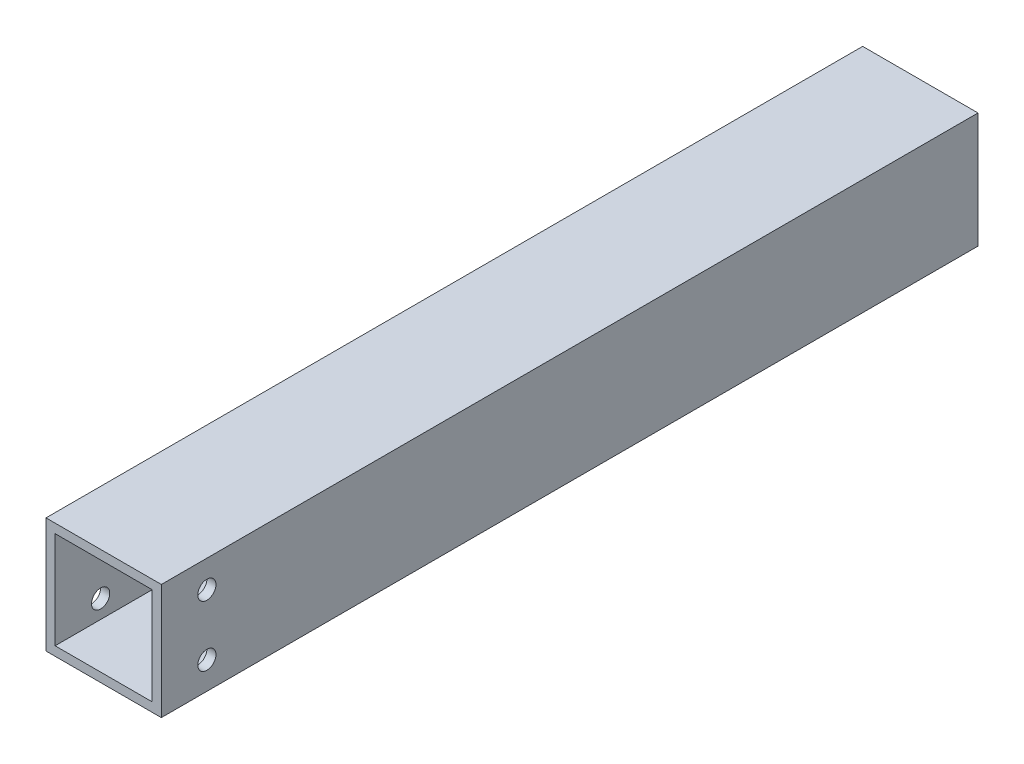
ISO-10303-21;
HEADER;
FILE_DESCRIPTION(('STEP AP214'),'2;1');
FILE_NAME('part.step','',(''),(''),'','','');
FILE_SCHEMA(('AUTOMOTIVE_DESIGN { 1 0 10303 214 1 1 1 1 }'));
ENDSEC;
DATA;
#1=APPLICATION_CONTEXT('core data for automotive mechanical design processes');
#2=APPLICATION_PROTOCOL_DEFINITION('international standard','automotive_design',2000,#1);
#3=PRODUCT_CONTEXT('',#1,'mechanical');
#4=PRODUCT('Part','Part','',(#3));
#5=PRODUCT_RELATED_PRODUCT_CATEGORY('part','',(#4));
#6=PRODUCT_DEFINITION_FORMATION('','',#4);
#7=PRODUCT_DEFINITION_CONTEXT('part definition',#1,'design');
#8=PRODUCT_DEFINITION('design','',#6,#7);
#9=PRODUCT_DEFINITION_SHAPE('','',#8);
#10=(LENGTH_UNIT() NAMED_UNIT(*) SI_UNIT(.MILLI.,.METRE.));
#11=(NAMED_UNIT(*) PLANE_ANGLE_UNIT() SI_UNIT($,.RADIAN.));
#12=(NAMED_UNIT(*) SI_UNIT($,.STERADIAN.) SOLID_ANGLE_UNIT());
#13=UNCERTAINTY_MEASURE_WITH_UNIT(LENGTH_MEASURE(1.E-05),#10,'distance_accuracy_value','');
#14=(GEOMETRIC_REPRESENTATION_CONTEXT(3) GLOBAL_UNCERTAINTY_ASSIGNED_CONTEXT((#13)) GLOBAL_UNIT_ASSIGNED_CONTEXT((#10,
#11,#12)) REPRESENTATION_CONTEXT('',''));
#15=CARTESIAN_POINT('',(0.,0.,0.));
#16=DIRECTION('',(0.,0.,1.));
#17=DIRECTION('',(1.,0.,0.));
#18=AXIS2_PLACEMENT_3D('',#15,#16,#17);
#19=CARTESIAN_POINT('',(0.,0.,269.06));
#20=DIRECTION('',(0.,0.,-1.));
#21=DIRECTION('',(-1.,0.,0.));
#22=AXIS2_PLACEMENT_3D('',#19,#20,#21);
#23=PLANE('',#22);
#24=DIRECTION('',(0.,1.,0.));
#25=VECTOR('',#24,1.);
#26=CARTESIAN_POINT('',(19.,-19.,269.06));
#27=LINE('',#26,#25);
#28=CARTESIAN_POINT('',(19.,-19.,269.06));
#29=VERTEX_POINT('',#28);
#30=CARTESIAN_POINT('',(19.,19.,269.06));
#31=VERTEX_POINT('',#30);
#32=EDGE_CURVE('E146',#29,#31,#27,.T.);
#33=ORIENTED_EDGE('',*,*,#32,.T.);
#34=DIRECTION('',(-1.,0.,0.));
#35=VECTOR('',#34,1.);
#36=CARTESIAN_POINT('',(-19.,19.,269.06));
#37=LINE('',#36,#35);
#38=CARTESIAN_POINT('',(-19.,19.,269.06));
#39=VERTEX_POINT('',#38);
#40=EDGE_CURVE('E149',#31,#39,#37,.T.);
#41=ORIENTED_EDGE('',*,*,#40,.T.);
#42=DIRECTION('',(0.,-1.,0.));
#43=VECTOR('',#42,1.);
#44=CARTESIAN_POINT('',(-19.,-19.,269.06));
#45=LINE('',#44,#43);
#46=CARTESIAN_POINT('',(-19.,-19.,269.06));
#47=VERTEX_POINT('',#46);
#48=EDGE_CURVE('E152',#39,#47,#45,.T.);
#49=ORIENTED_EDGE('',*,*,#48,.T.);
#50=DIRECTION('',(1.,0.,0.));
#51=VECTOR('',#50,1.);
#52=CARTESIAN_POINT('',(-19.,-19.,269.06));
#53=LINE('',#52,#51);
#54=EDGE_CURVE('E154',#47,#29,#53,.T.);
#55=ORIENTED_EDGE('',*,*,#54,.T.);
#56=EDGE_LOOP('',(#33,#41,#49,#55));
#57=FACE_BOUND('',#56,.T.);
#58=DIRECTION('',(0.,-1.,0.));
#59=VECTOR('',#58,1.);
#60=CARTESIAN_POINT('',(-16.,-16.,269.06));
#61=LINE('',#60,#59);
#62=CARTESIAN_POINT('',(-16.,16.,269.06));
#63=VERTEX_POINT('',#62);
#64=CARTESIAN_POINT('',(-16.,-16.,269.06));
#65=VERTEX_POINT('',#64);
#66=EDGE_CURVE('E108',#63,#65,#61,.T.);
#67=ORIENTED_EDGE('',*,*,#66,.F.);
#68=DIRECTION('',(-1.,0.,0.));
#69=VECTOR('',#68,1.);
#70=CARTESIAN_POINT('',(-16.,16.,269.06));
#71=LINE('',#70,#69);
#72=CARTESIAN_POINT('',(16.,16.,269.06));
#73=VERTEX_POINT('',#72);
#74=EDGE_CURVE('E130',#73,#63,#71,.T.);
#75=ORIENTED_EDGE('',*,*,#74,.F.);
#76=DIRECTION('',(0.,1.,0.));
#77=VECTOR('',#76,1.);
#78=CARTESIAN_POINT('',(16.,-16.,269.06));
#79=LINE('',#78,#77);
#80=CARTESIAN_POINT('',(16.,-16.,269.06));
#81=VERTEX_POINT('',#80);
#82=EDGE_CURVE('E128',#81,#73,#79,.T.);
#83=ORIENTED_EDGE('',*,*,#82,.F.);
#84=DIRECTION('',(1.,0.,0.));
#85=VECTOR('',#84,1.);
#86=CARTESIAN_POINT('',(-16.,-16.,269.06));
#87=LINE('',#86,#85);
#88=EDGE_CURVE('E116',#65,#81,#87,.T.);
#89=ORIENTED_EDGE('',*,*,#88,.F.);
#90=EDGE_LOOP('',(#67,#75,#83,#89));
#91=FACE_BOUND('',#90,.T.);
#92=ADVANCED_FACE('F41',(#57,#91),#23,.F.);
#93=CARTESIAN_POINT('',(0.,0.,0.));
#94=DIRECTION('',(0.,0.,-1.));
#95=DIRECTION('',(-1.,0.,0.));
#96=AXIS2_PLACEMENT_3D('',#93,#94,#95);
#97=PLANE('',#96);
#98=DIRECTION('',(0.,1.,0.));
#99=VECTOR('',#98,1.);
#100=CARTESIAN_POINT('',(19.,-19.,0.));
#101=LINE('',#100,#99);
#102=CARTESIAN_POINT('',(19.,-19.,0.));
#103=VERTEX_POINT('',#102);
#104=CARTESIAN_POINT('',(19.,19.,0.));
#105=VERTEX_POINT('',#104);
#106=EDGE_CURVE('E124',#103,#105,#101,.T.);
#107=ORIENTED_EDGE('',*,*,#106,.F.);
#108=DIRECTION('',(1.,0.,0.));
#109=VECTOR('',#108,1.);
#110=CARTESIAN_POINT('',(-19.,-19.,0.));
#111=LINE('',#110,#109);
#112=CARTESIAN_POINT('',(-19.,-19.,0.));
#113=VERTEX_POINT('',#112);
#114=EDGE_CURVE('E150',#113,#103,#111,.T.);
#115=ORIENTED_EDGE('',*,*,#114,.F.);
#116=DIRECTION('',(0.,-1.,0.));
#117=VECTOR('',#116,1.);
#118=CARTESIAN_POINT('',(-19.,-19.,0.));
#119=LINE('',#118,#117);
#120=CARTESIAN_POINT('',(-19.,19.,0.));
#121=VERTEX_POINT('',#120);
#122=EDGE_CURVE('E161',#121,#113,#119,.T.);
#123=ORIENTED_EDGE('',*,*,#122,.F.);
#124=DIRECTION('',(-1.,0.,0.));
#125=VECTOR('',#124,1.);
#126=CARTESIAN_POINT('',(-19.,19.,0.));
#127=LINE('',#126,#125);
#128=EDGE_CURVE('E159',#105,#121,#127,.T.);
#129=ORIENTED_EDGE('',*,*,#128,.F.);
#130=EDGE_LOOP('',(#107,#115,#123,#129));
#131=FACE_BOUND('',#130,.T.);
#132=DIRECTION('',(-1.,0.,0.));
#133=VECTOR('',#132,1.);
#134=CARTESIAN_POINT('',(-16.,16.,0.));
#135=LINE('',#134,#133);
#136=CARTESIAN_POINT('',(16.,16.,0.));
#137=VERTEX_POINT('',#136);
#138=CARTESIAN_POINT('',(-16.,16.,0.));
#139=VERTEX_POINT('',#138);
#140=EDGE_CURVE('E117',#137,#139,#135,.T.);
#141=ORIENTED_EDGE('',*,*,#140,.T.);
#142=DIRECTION('',(0.,-1.,0.));
#143=VECTOR('',#142,1.);
#144=CARTESIAN_POINT('',(-16.,-16.,0.));
#145=LINE('',#144,#143);
#146=CARTESIAN_POINT('',(-16.,-16.,0.));
#147=VERTEX_POINT('',#146);
#148=EDGE_CURVE('E66',#139,#147,#145,.T.);
#149=ORIENTED_EDGE('',*,*,#148,.T.);
#150=DIRECTION('',(1.,0.,0.));
#151=VECTOR('',#150,1.);
#152=CARTESIAN_POINT('',(-16.,-16.,0.));
#153=LINE('',#152,#151);
#154=CARTESIAN_POINT('',(16.,-16.,0.));
#155=VERTEX_POINT('',#154);
#156=EDGE_CURVE('E123',#147,#155,#153,.T.);
#157=ORIENTED_EDGE('',*,*,#156,.T.);
#158=DIRECTION('',(0.,1.,0.));
#159=VECTOR('',#158,1.);
#160=CARTESIAN_POINT('',(16.,-16.,0.));
#161=LINE('',#160,#159);
#162=EDGE_CURVE('E138',#155,#137,#161,.T.);
#163=ORIENTED_EDGE('',*,*,#162,.T.);
#164=EDGE_LOOP('',(#141,#149,#157,#163));
#165=FACE_BOUND('',#164,.T.);
#166=ADVANCED_FACE('F208',(#131,#165),#97,.T.);
#167=CARTESIAN_POINT('',(19.,-19.,269.06));
#168=DIRECTION('',(-1.,0.,0.));
#169=DIRECTION('',(0.,0.,1.));
#170=AXIS2_PLACEMENT_3D('',#167,#168,#169);
#171=PLANE('',#170);
#172=CARTESIAN_POINT('',(19.,-10.,254.06));
#173=DIRECTION('',(-1.,0.,0.));
#174=DIRECTION('',(0.,0.,1.));
#175=AXIS2_PLACEMENT_3D('',#172,#173,#174);
#176=CIRCLE('',#175,2.99999999999999);
#177=CARTESIAN_POINT('',(19.,-10.,257.06));
#178=VERTEX_POINT('',#177);
#179=EDGE_CURVE('E179',#178,#178,#176,.T.);
#180=ORIENTED_EDGE('',*,*,#179,.T.);
#181=EDGE_LOOP('',(#180));
#182=FACE_BOUND('',#181,.T.);
#183=CARTESIAN_POINT('',(19.,10.,254.06));
#184=DIRECTION('',(-1.,0.,0.));
#185=DIRECTION('',(0.,0.,1.));
#186=AXIS2_PLACEMENT_3D('',#183,#184,#185);
#187=CIRCLE('',#186,2.99999999999999);
#188=CARTESIAN_POINT('',(19.,10.,257.06));
#189=VERTEX_POINT('',#188);
#190=EDGE_CURVE('E136',#189,#189,#187,.T.);
#191=ORIENTED_EDGE('',*,*,#190,.T.);
#192=EDGE_LOOP('',(#191));
#193=FACE_BOUND('',#192,.T.);
#194=ORIENTED_EDGE('',*,*,#106,.T.);
#195=DIRECTION('',(0.,0.,-1.));
#196=VECTOR('',#195,1.);
#197=CARTESIAN_POINT('',(19.,19.,269.06));
#198=LINE('',#197,#196);
#199=EDGE_CURVE('E11',#31,#105,#198,.T.);
#200=ORIENTED_EDGE('',*,*,#199,.F.);
#201=ORIENTED_EDGE('',*,*,#32,.F.);
#202=DIRECTION('',(0.,0.,-1.));
#203=VECTOR('',#202,1.);
#204=CARTESIAN_POINT('',(19.,-19.,269.06));
#205=LINE('',#204,#203);
#206=EDGE_CURVE('E156',#29,#103,#205,.T.);
#207=ORIENTED_EDGE('',*,*,#206,.T.);
#208=EDGE_LOOP('',(#194,#200,#201,#207));
#209=FACE_BOUND('',#208,.T.);
#210=ADVANCED_FACE('F43',(#182,#193,#209),#171,.F.);
#211=CARTESIAN_POINT('',(-19.,19.,269.06));
#212=DIRECTION('',(0.,-1.,0.));
#213=DIRECTION('',(0.,0.,-1.));
#214=AXIS2_PLACEMENT_3D('',#211,#212,#213);
#215=PLANE('',#214);
#216=ORIENTED_EDGE('',*,*,#128,.T.);
#217=DIRECTION('',(0.,0.,-1.));
#218=VECTOR('',#217,1.);
#219=CARTESIAN_POINT('',(-19.,19.,269.06));
#220=LINE('',#219,#218);
#221=EDGE_CURVE('E50',#39,#121,#220,.T.);
#222=ORIENTED_EDGE('',*,*,#221,.F.);
#223=ORIENTED_EDGE('',*,*,#40,.F.);
#224=ORIENTED_EDGE('',*,*,#199,.T.);
#225=EDGE_LOOP('',(#216,#222,#223,#224));
#226=FACE_BOUND('',#225,.T.);
#227=ADVANCED_FACE('F225',(#226),#215,.F.);
#228=CARTESIAN_POINT('',(-19.,-19.,269.06));
#229=DIRECTION('',(1.,0.,0.));
#230=DIRECTION('',(0.,0.,-1.));
#231=AXIS2_PLACEMENT_3D('',#228,#229,#230);
#232=PLANE('',#231);
#233=CARTESIAN_POINT('',(-19.,-10.,254.06));
#234=DIRECTION('',(1.,0.,0.));
#235=DIRECTION('',(0.,0.,-1.));
#236=AXIS2_PLACEMENT_3D('',#233,#234,#235);
#237=CIRCLE('',#236,2.99999999999999);
#238=CARTESIAN_POINT('',(-19.,-10.,251.06));
#239=VERTEX_POINT('',#238);
#240=EDGE_CURVE('E257',#239,#239,#237,.T.);
#241=ORIENTED_EDGE('',*,*,#240,.T.);
#242=EDGE_LOOP('',(#241));
#243=FACE_BOUND('',#242,.T.);
#244=CARTESIAN_POINT('',(-19.,10.,254.06));
#245=DIRECTION('',(1.,0.,0.));
#246=DIRECTION('',(0.,0.,-1.));
#247=AXIS2_PLACEMENT_3D('',#244,#245,#246);
#248=CIRCLE('',#247,2.99999999999999);
#249=CARTESIAN_POINT('',(-19.,10.,251.06));
#250=VERTEX_POINT('',#249);
#251=EDGE_CURVE('E173',#250,#250,#248,.T.);
#252=ORIENTED_EDGE('',*,*,#251,.T.);
#253=EDGE_LOOP('',(#252));
#254=FACE_BOUND('',#253,.T.);
#255=ORIENTED_EDGE('',*,*,#122,.T.);
#256=DIRECTION('',(0.,0.,-1.));
#257=VECTOR('',#256,1.);
#258=CARTESIAN_POINT('',(-19.,-19.,269.06));
#259=LINE('',#258,#257);
#260=EDGE_CURVE('E166',#47,#113,#259,.T.);
#261=ORIENTED_EDGE('',*,*,#260,.F.);
#262=ORIENTED_EDGE('',*,*,#48,.F.);
#263=ORIENTED_EDGE('',*,*,#221,.T.);
#264=EDGE_LOOP('',(#255,#261,#262,#263));
#265=FACE_BOUND('',#264,.T.);
#266=ADVANCED_FACE('F222',(#243,#254,#265),#232,.F.);
#267=CARTESIAN_POINT('',(-19.,-19.,269.06));
#268=DIRECTION('',(0.,1.,0.));
#269=DIRECTION('',(0.,0.,1.));
#270=AXIS2_PLACEMENT_3D('',#267,#268,#269);
#271=PLANE('',#270);
#272=ORIENTED_EDGE('',*,*,#114,.T.);
#273=ORIENTED_EDGE('',*,*,#206,.F.);
#274=ORIENTED_EDGE('',*,*,#54,.F.);
#275=ORIENTED_EDGE('',*,*,#260,.T.);
#276=EDGE_LOOP('',(#272,#273,#274,#275));
#277=FACE_BOUND('',#276,.T.);
#278=ADVANCED_FACE('F219',(#277),#271,.F.);
#279=CARTESIAN_POINT('',(-16.,-16.,269.06));
#280=DIRECTION('',(1.,0.,0.));
#281=DIRECTION('',(0.,0.,-1.));
#282=AXIS2_PLACEMENT_3D('',#279,#280,#281);
#283=PLANE('',#282);
#284=CARTESIAN_POINT('',(-16.,-10.,254.06));
#285=DIRECTION('',(1.,0.,0.));
#286=DIRECTION('',(0.,0.,-1.));
#287=AXIS2_PLACEMENT_3D('',#284,#285,#286);
#288=CIRCLE('',#287,2.99999999999999);
#289=CARTESIAN_POINT('',(-16.,-10.,251.06));
#290=VERTEX_POINT('',#289);
#291=EDGE_CURVE('E184',#290,#290,#288,.T.);
#292=ORIENTED_EDGE('',*,*,#291,.F.);
#293=EDGE_LOOP('',(#292));
#294=FACE_BOUND('',#293,.T.);
#295=CARTESIAN_POINT('',(-16.,10.,254.06));
#296=DIRECTION('',(1.,0.,0.));
#297=DIRECTION('',(0.,0.,-1.));
#298=AXIS2_PLACEMENT_3D('',#295,#296,#297);
#299=CIRCLE('',#298,2.99999999999999);
#300=CARTESIAN_POINT('',(-16.,10.,251.06));
#301=VERTEX_POINT('',#300);
#302=EDGE_CURVE('E172',#301,#301,#299,.T.);
#303=ORIENTED_EDGE('',*,*,#302,.F.);
#304=EDGE_LOOP('',(#303));
#305=FACE_BOUND('',#304,.T.);
#306=ORIENTED_EDGE('',*,*,#148,.F.);
#307=DIRECTION('',(0.,0.,-1.));
#308=VECTOR('',#307,1.);
#309=CARTESIAN_POINT('',(-16.,16.,269.06));
#310=LINE('',#309,#308);
#311=EDGE_CURVE('E112',#63,#139,#310,.T.);
#312=ORIENTED_EDGE('',*,*,#311,.F.);
#313=ORIENTED_EDGE('',*,*,#66,.T.);
#314=DIRECTION('',(0.,0.,-1.));
#315=VECTOR('',#314,1.);
#316=CARTESIAN_POINT('',(-16.,-16.,269.06));
#317=LINE('',#316,#315);
#318=EDGE_CURVE('E111',#65,#147,#317,.T.);
#319=ORIENTED_EDGE('',*,*,#318,.T.);
#320=EDGE_LOOP('',(#306,#312,#313,#319));
#321=FACE_BOUND('',#320,.T.);
#322=ADVANCED_FACE('F110',(#294,#305,#321),#283,.T.);
#323=CARTESIAN_POINT('',(-16.,-16.,269.06));
#324=DIRECTION('',(0.,1.,0.));
#325=DIRECTION('',(0.,0.,1.));
#326=AXIS2_PLACEMENT_3D('',#323,#324,#325);
#327=PLANE('',#326);
#328=ORIENTED_EDGE('',*,*,#156,.F.);
#329=ORIENTED_EDGE('',*,*,#318,.F.);
#330=ORIENTED_EDGE('',*,*,#88,.T.);
#331=DIRECTION('',(0.,0.,-1.));
#332=VECTOR('',#331,1.);
#333=CARTESIAN_POINT('',(16.,-16.,269.06));
#334=LINE('',#333,#332);
#335=EDGE_CURVE('E125',#81,#155,#334,.T.);
#336=ORIENTED_EDGE('',*,*,#335,.T.);
#337=EDGE_LOOP('',(#328,#329,#330,#336));
#338=FACE_BOUND('',#337,.T.);
#339=ADVANCED_FACE('F120',(#338),#327,.T.);
#340=CARTESIAN_POINT('',(16.,-16.,269.06));
#341=DIRECTION('',(-1.,0.,0.));
#342=DIRECTION('',(0.,0.,1.));
#343=AXIS2_PLACEMENT_3D('',#340,#341,#342);
#344=PLANE('',#343);
#345=CARTESIAN_POINT('',(16.,-10.,254.06));
#346=DIRECTION('',(-1.,0.,0.));
#347=DIRECTION('',(0.,0.,1.));
#348=AXIS2_PLACEMENT_3D('',#345,#346,#347);
#349=CIRCLE('',#348,2.99999999999999);
#350=CARTESIAN_POINT('',(16.,-10.,257.06));
#351=VERTEX_POINT('',#350);
#352=EDGE_CURVE('E45',#351,#351,#349,.T.);
#353=ORIENTED_EDGE('',*,*,#352,.F.);
#354=EDGE_LOOP('',(#353));
#355=FACE_BOUND('',#354,.T.);
#356=CARTESIAN_POINT('',(16.,10.,254.06));
#357=DIRECTION('',(-1.,0.,0.));
#358=DIRECTION('',(0.,0.,1.));
#359=AXIS2_PLACEMENT_3D('',#356,#357,#358);
#360=CIRCLE('',#359,2.99999999999999);
#361=CARTESIAN_POINT('',(16.,10.,257.06));
#362=VERTEX_POINT('',#361);
#363=EDGE_CURVE('E170',#362,#362,#360,.T.);
#364=ORIENTED_EDGE('',*,*,#363,.F.);
#365=EDGE_LOOP('',(#364));
#366=FACE_BOUND('',#365,.T.);
#367=ORIENTED_EDGE('',*,*,#162,.F.);
#368=ORIENTED_EDGE('',*,*,#335,.F.);
#369=ORIENTED_EDGE('',*,*,#82,.T.);
#370=DIRECTION('',(0.,0.,-1.));
#371=VECTOR('',#370,1.);
#372=CARTESIAN_POINT('',(16.,16.,269.06));
#373=LINE('',#372,#371);
#374=EDGE_CURVE('E58',#73,#137,#373,.T.);
#375=ORIENTED_EDGE('',*,*,#374,.T.);
#376=EDGE_LOOP('',(#367,#368,#369,#375));
#377=FACE_BOUND('',#376,.T.);
#378=ADVANCED_FACE('F204',(#355,#366,#377),#344,.T.);
#379=CARTESIAN_POINT('',(-16.,16.,269.06));
#380=DIRECTION('',(0.,-1.,0.));
#381=DIRECTION('',(0.,0.,-1.));
#382=AXIS2_PLACEMENT_3D('',#379,#380,#381);
#383=PLANE('',#382);
#384=ORIENTED_EDGE('',*,*,#140,.F.);
#385=ORIENTED_EDGE('',*,*,#374,.F.);
#386=ORIENTED_EDGE('',*,*,#74,.T.);
#387=ORIENTED_EDGE('',*,*,#311,.T.);
#388=EDGE_LOOP('',(#384,#385,#386,#387));
#389=FACE_BOUND('',#388,.T.);
#390=ADVANCED_FACE('F195',(#389),#383,.T.);
#391=CARTESIAN_POINT('',(-19.,10.,254.06));
#392=DIRECTION('',(1.,0.,0.));
#393=DIRECTION('',(0.,0.,-1.));
#394=AXIS2_PLACEMENT_3D('',#391,#392,#393);
#395=CYLINDRICAL_SURFACE('',#394,2.99999999999999);
#396=ORIENTED_EDGE('',*,*,#363,.T.);
#397=EDGE_LOOP('',(#396));
#398=FACE_BOUND('',#397,.T.);
#399=ORIENTED_EDGE('',*,*,#190,.F.);
#400=EDGE_LOOP('',(#399));
#401=FACE_BOUND('',#400,.T.);
#402=ADVANCED_FACE('F192',(#398,#401),#395,.F.);
#403=ORIENTED_EDGE('',*,*,#302,.T.);
#404=EDGE_LOOP('',(#403));
#405=FACE_BOUND('',#404,.T.);
#406=ORIENTED_EDGE('',*,*,#251,.F.);
#407=EDGE_LOOP('',(#406));
#408=FACE_BOUND('',#407,.T.);
#409=ADVANCED_FACE('F194',(#405,#408),#395,.F.);
#410=CARTESIAN_POINT('',(-19.,-10.,254.06));
#411=DIRECTION('',(1.,0.,0.));
#412=DIRECTION('',(0.,0.,-1.));
#413=AXIS2_PLACEMENT_3D('',#410,#411,#412);
#414=CYLINDRICAL_SURFACE('',#413,2.99999999999999);
#415=ORIENTED_EDGE('',*,*,#352,.T.);
#416=EDGE_LOOP('',(#415));
#417=FACE_BOUND('',#416,.T.);
#418=ORIENTED_EDGE('',*,*,#179,.F.);
#419=EDGE_LOOP('',(#418));
#420=FACE_BOUND('',#419,.T.);
#421=ADVANCED_FACE('F201',(#417,#420),#414,.F.);
#422=ORIENTED_EDGE('',*,*,#291,.T.);
#423=EDGE_LOOP('',(#422));
#424=FACE_BOUND('',#423,.T.);
#425=ORIENTED_EDGE('',*,*,#240,.F.);
#426=EDGE_LOOP('',(#425));
#427=FACE_BOUND('',#426,.T.);
#428=ADVANCED_FACE('F263',(#424,#427),#414,.F.);
#429=CLOSED_SHELL('',(#92,#166,#210,#227,#266,#278,#322,#339,#378,#390,#402,#409,#421,#428));
#430=MANIFOLD_SOLID_BREP('B2',#429);
#431=ADVANCED_BREP_SHAPE_REPRESENTATION('',(#18,#430),#14);
#432=SHAPE_DEFINITION_REPRESENTATION(#9,#431);
ENDSEC;
END-ISO-10303-21;
